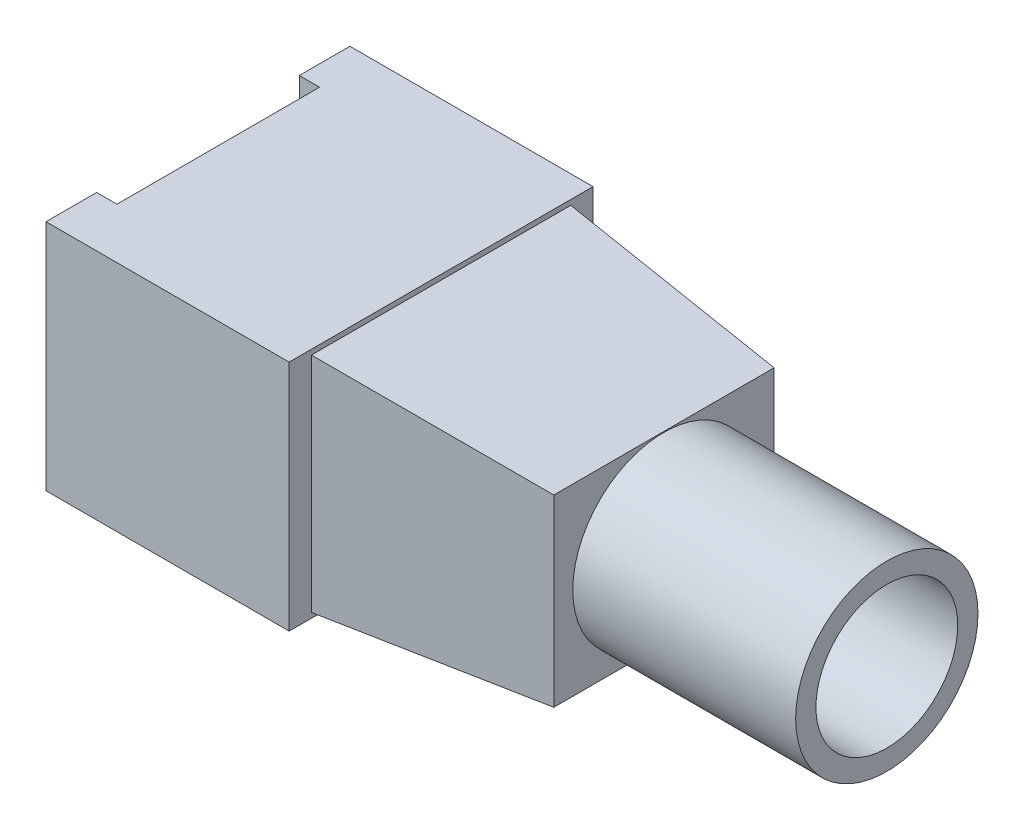
ISO-10303-21;
HEADER;
FILE_DESCRIPTION(('STEP AP214'),'2;1');
FILE_NAME('part.step','',(''),(''),'','','');
FILE_SCHEMA(('AUTOMOTIVE_DESIGN { 1 0 10303 214 1 1 1 1 }'));
ENDSEC;
DATA;
#1=APPLICATION_CONTEXT('core data for automotive mechanical design processes');
#2=APPLICATION_PROTOCOL_DEFINITION('international standard','automotive_design',2000,#1);
#3=PRODUCT_CONTEXT('',#1,'mechanical');
#4=PRODUCT('Part','Part','',(#3));
#5=PRODUCT_RELATED_PRODUCT_CATEGORY('part','',(#4));
#6=PRODUCT_DEFINITION_FORMATION('','',#4);
#7=PRODUCT_DEFINITION_CONTEXT('part definition',#1,'design');
#8=PRODUCT_DEFINITION('design','',#6,#7);
#9=PRODUCT_DEFINITION_SHAPE('','',#8);
#10=(LENGTH_UNIT() NAMED_UNIT(*) SI_UNIT(.MILLI.,.METRE.));
#11=(NAMED_UNIT(*) PLANE_ANGLE_UNIT() SI_UNIT($,.RADIAN.));
#12=(NAMED_UNIT(*) SI_UNIT($,.STERADIAN.) SOLID_ANGLE_UNIT());
#13=UNCERTAINTY_MEASURE_WITH_UNIT(LENGTH_MEASURE(1.E-05),#10,'distance_accuracy_value','');
#14=(GEOMETRIC_REPRESENTATION_CONTEXT(3) GLOBAL_UNCERTAINTY_ASSIGNED_CONTEXT((#13)) GLOBAL_UNIT_ASSIGNED_CONTEXT((#10,
#11,#12)) REPRESENTATION_CONTEXT('',''));
#15=CARTESIAN_POINT('',(0.,0.,0.));
#16=DIRECTION('',(0.,0.,1.));
#17=DIRECTION('',(1.,0.,0.));
#18=AXIS2_PLACEMENT_3D('',#15,#16,#17);
#19=CARTESIAN_POINT('',(6.,11.5,-7.5));
#20=DIRECTION('',(-1.,0.,0.));
#21=DIRECTION('',(0.,0.,1.));
#22=AXIS2_PLACEMENT_3D('',#19,#20,#21);
#23=PLANE('',#22);
#24=DIRECTION('',(0.,0.,-1.));
#25=VECTOR('',#24,1.);
#26=CARTESIAN_POINT('',(6.,0.,-7.5));
#27=LINE('',#26,#25);
#28=CARTESIAN_POINT('',(6.,0.,7.5));
#29=VERTEX_POINT('',#28);
#30=CARTESIAN_POINT('',(6.,0.,-7.5));
#31=VERTEX_POINT('',#30);
#32=EDGE_CURVE('E173',#29,#31,#27,.T.);
#33=ORIENTED_EDGE('',*,*,#32,.T.);
#34=DIRECTION('',(0.,-1.,0.));
#35=VECTOR('',#34,1.);
#36=CARTESIAN_POINT('',(6.,11.5,-7.5));
#37=LINE('',#36,#35);
#38=CARTESIAN_POINT('',(6.,11.5,-7.5));
#39=VERTEX_POINT('',#38);
#40=EDGE_CURVE('E41',#39,#31,#37,.T.);
#41=ORIENTED_EDGE('',*,*,#40,.F.);
#42=DIRECTION('',(0.,0.,-1.));
#43=VECTOR('',#42,1.);
#44=CARTESIAN_POINT('',(6.,11.5,-7.5));
#45=LINE('',#44,#43);
#46=CARTESIAN_POINT('',(6.,11.5,7.5));
#47=VERTEX_POINT('',#46);
#48=EDGE_CURVE('E154',#47,#39,#45,.T.);
#49=ORIENTED_EDGE('',*,*,#48,.F.);
#50=DIRECTION('',(0.,-1.,0.));
#51=VECTOR('',#50,1.);
#52=CARTESIAN_POINT('',(6.,11.5,7.5));
#53=LINE('',#52,#51);
#54=EDGE_CURVE('E172',#47,#29,#53,.T.);
#55=ORIENTED_EDGE('',*,*,#54,.T.);
#56=EDGE_LOOP('',(#33,#41,#49,#55));
#57=FACE_BOUND('',#56,.T.);
#58=DIRECTION('',(0.,1.,0.));
#59=VECTOR('',#58,1.);
#60=CARTESIAN_POINT('',(6.,11.25,-6.4));
#61=LINE('',#60,#59);
#62=CARTESIAN_POINT('',(6.,0.249999999999999,-6.4));
#63=VERTEX_POINT('',#62);
#64=CARTESIAN_POINT('',(6.,11.25,-6.4));
#65=VERTEX_POINT('',#64);
#66=EDGE_CURVE('E118',#63,#65,#61,.T.);
#67=ORIENTED_EDGE('',*,*,#66,.F.);
#68=DIRECTION('',(0.,0.,-1.));
#69=VECTOR('',#68,1.);
#70=CARTESIAN_POINT('',(6.,0.249999999999999,6.4));
#71=LINE('',#70,#69);
#72=CARTESIAN_POINT('',(6.,0.25,6.4));
#73=VERTEX_POINT('',#72);
#74=EDGE_CURVE('E120',#73,#63,#71,.T.);
#75=ORIENTED_EDGE('',*,*,#74,.F.);
#76=DIRECTION('',(0.,-1.,0.));
#77=VECTOR('',#76,1.);
#78=CARTESIAN_POINT('',(6.,11.25,6.4));
#79=LINE('',#78,#77);
#80=CARTESIAN_POINT('',(6.,11.25,6.4));
#81=VERTEX_POINT('',#80);
#82=EDGE_CURVE('E53',#81,#73,#79,.T.);
#83=ORIENTED_EDGE('',*,*,#82,.F.);
#84=DIRECTION('',(0.,0.,1.));
#85=VECTOR('',#84,1.);
#86=CARTESIAN_POINT('',(6.,11.25,6.4));
#87=LINE('',#86,#85);
#88=EDGE_CURVE('E48',#65,#81,#87,.T.);
#89=ORIENTED_EDGE('',*,*,#88,.F.);
#90=EDGE_LOOP('',(#67,#75,#83,#89));
#91=FACE_BOUND('',#90,.T.);
#92=ADVANCED_FACE('F34',(#57,#91),#23,.F.);
#93=CARTESIAN_POINT('',(-6.,11.5,-7.5));
#94=DIRECTION('',(0.,0.,1.));
#95=DIRECTION('',(1.,0.,0.));
#96=AXIS2_PLACEMENT_3D('',#93,#94,#95);
#97=PLANE('',#96);
#98=DIRECTION('',(-1.,0.,0.));
#99=VECTOR('',#98,1.);
#100=CARTESIAN_POINT('',(-6.,0.,-7.5));
#101=LINE('',#100,#99);
#102=CARTESIAN_POINT('',(-6.,0.,-7.5));
#103=VERTEX_POINT('',#102);
#104=EDGE_CURVE('E176',#31,#103,#101,.T.);
#105=ORIENTED_EDGE('',*,*,#104,.T.);
#106=DIRECTION('',(0.,-1.,0.));
#107=VECTOR('',#106,1.);
#108=CARTESIAN_POINT('',(-6.,11.5,-7.5));
#109=LINE('',#108,#107);
#110=CARTESIAN_POINT('',(-6.,11.5,-7.5));
#111=VERTEX_POINT('',#110);
#112=EDGE_CURVE('E206',#111,#103,#109,.T.);
#113=ORIENTED_EDGE('',*,*,#112,.F.);
#114=DIRECTION('',(-1.,0.,0.));
#115=VECTOR('',#114,1.);
#116=CARTESIAN_POINT('',(-6.,11.5,-7.5));
#117=LINE('',#116,#115);
#118=EDGE_CURVE('E157',#39,#111,#117,.T.);
#119=ORIENTED_EDGE('',*,*,#118,.F.);
#120=ORIENTED_EDGE('',*,*,#40,.T.);
#121=EDGE_LOOP('',(#105,#113,#119,#120));
#122=FACE_BOUND('',#121,.T.);
#123=ADVANCED_FACE('F211',(#122),#97,.F.);
#124=CARTESIAN_POINT('',(-6.,11.5,-7.5));
#125=DIRECTION('',(1.,0.,0.));
#126=DIRECTION('',(0.,0.,-1.));
#127=AXIS2_PLACEMENT_3D('',#124,#125,#126);
#128=PLANE('',#127);
#129=DIRECTION('',(0.,0.,1.));
#130=VECTOR('',#129,1.);
#131=CARTESIAN_POINT('',(-6.,0.,-7.5));
#132=LINE('',#131,#130);
#133=CARTESIAN_POINT('',(-6.,0.,-5.));
#134=VERTEX_POINT('',#133);
#135=EDGE_CURVE('E178',#103,#134,#132,.T.);
#136=ORIENTED_EDGE('',*,*,#135,.T.);
#137=DIRECTION('',(0.,-1.,0.));
#138=VECTOR('',#137,1.);
#139=CARTESIAN_POINT('',(-6.,11.5,-5.));
#140=LINE('',#139,#138);
#141=CARTESIAN_POINT('',(-6.,11.5,-5.));
#142=VERTEX_POINT('',#141);
#143=EDGE_CURVE('E203',#142,#134,#140,.T.);
#144=ORIENTED_EDGE('',*,*,#143,.F.);
#145=DIRECTION('',(0.,0.,1.));
#146=VECTOR('',#145,1.);
#147=CARTESIAN_POINT('',(-6.,11.5,-7.5));
#148=LINE('',#147,#146);
#149=EDGE_CURVE('E160',#111,#142,#148,.T.);
#150=ORIENTED_EDGE('',*,*,#149,.F.);
#151=ORIENTED_EDGE('',*,*,#112,.T.);
#152=EDGE_LOOP('',(#136,#144,#150,#151));
#153=FACE_BOUND('',#152,.T.);
#154=ADVANCED_FACE('F226',(#153),#128,.F.);
#155=CARTESIAN_POINT('',(-6.,11.5,-5.));
#156=DIRECTION('',(0.,0.,-1.));
#157=DIRECTION('',(-1.,0.,0.));
#158=AXIS2_PLACEMENT_3D('',#155,#156,#157);
#159=PLANE('',#158);
#160=DIRECTION('',(1.,0.,0.));
#161=VECTOR('',#160,1.);
#162=CARTESIAN_POINT('',(-6.,0.,-5.));
#163=LINE('',#162,#161);
#164=CARTESIAN_POINT('',(-5.,0.,-5.));
#165=VERTEX_POINT('',#164);
#166=EDGE_CURVE('E180',#134,#165,#163,.T.);
#167=ORIENTED_EDGE('',*,*,#166,.T.);
#168=DIRECTION('',(0.,-1.,0.));
#169=VECTOR('',#168,1.);
#170=CARTESIAN_POINT('',(-5.,11.5,-5.));
#171=LINE('',#170,#169);
#172=CARTESIAN_POINT('',(-5.,11.5,-5.));
#173=VERTEX_POINT('',#172);
#174=EDGE_CURVE('E200',#173,#165,#171,.T.);
#175=ORIENTED_EDGE('',*,*,#174,.F.);
#176=DIRECTION('',(1.,0.,0.));
#177=VECTOR('',#176,1.);
#178=CARTESIAN_POINT('',(-6.,11.5,-5.));
#179=LINE('',#178,#177);
#180=EDGE_CURVE('E162',#142,#173,#179,.T.);
#181=ORIENTED_EDGE('',*,*,#180,.F.);
#182=ORIENTED_EDGE('',*,*,#143,.T.);
#183=EDGE_LOOP('',(#167,#175,#181,#182));
#184=FACE_BOUND('',#183,.T.);
#185=ADVANCED_FACE('F230',(#184),#159,.F.);
#186=CARTESIAN_POINT('',(-5.,11.5,5.));
#187=DIRECTION('',(1.,0.,0.));
#188=DIRECTION('',(0.,0.,-1.));
#189=AXIS2_PLACEMENT_3D('',#186,#187,#188);
#190=PLANE('',#189);
#191=DIRECTION('',(0.,0.,1.));
#192=VECTOR('',#191,1.);
#193=CARTESIAN_POINT('',(-5.,0.,5.));
#194=LINE('',#193,#192);
#195=CARTESIAN_POINT('',(-5.,0.,5.));
#196=VERTEX_POINT('',#195);
#197=EDGE_CURVE('E182',#165,#196,#194,.T.);
#198=ORIENTED_EDGE('',*,*,#197,.T.);
#199=DIRECTION('',(0.,-1.,0.));
#200=VECTOR('',#199,1.);
#201=CARTESIAN_POINT('',(-5.,11.5,5.));
#202=LINE('',#201,#200);
#203=CARTESIAN_POINT('',(-5.,11.5,5.));
#204=VERTEX_POINT('',#203);
#205=EDGE_CURVE('E197',#204,#196,#202,.T.);
#206=ORIENTED_EDGE('',*,*,#205,.F.);
#207=DIRECTION('',(0.,0.,1.));
#208=VECTOR('',#207,1.);
#209=CARTESIAN_POINT('',(-5.,11.5,5.));
#210=LINE('',#209,#208);
#211=EDGE_CURVE('E164',#173,#204,#210,.T.);
#212=ORIENTED_EDGE('',*,*,#211,.F.);
#213=ORIENTED_EDGE('',*,*,#174,.T.);
#214=EDGE_LOOP('',(#198,#206,#212,#213));
#215=FACE_BOUND('',#214,.T.);
#216=ADVANCED_FACE('F249',(#215),#190,.F.);
#217=CARTESIAN_POINT('',(-6.,11.5,5.));
#218=DIRECTION('',(0.,0.,1.));
#219=DIRECTION('',(1.,0.,0.));
#220=AXIS2_PLACEMENT_3D('',#217,#218,#219);
#221=PLANE('',#220);
#222=DIRECTION('',(-1.,0.,0.));
#223=VECTOR('',#222,1.);
#224=CARTESIAN_POINT('',(-6.,0.,5.));
#225=LINE('',#224,#223);
#226=CARTESIAN_POINT('',(-6.,0.,5.));
#227=VERTEX_POINT('',#226);
#228=EDGE_CURVE('E184',#196,#227,#225,.T.);
#229=ORIENTED_EDGE('',*,*,#228,.T.);
#230=DIRECTION('',(0.,-1.,0.));
#231=VECTOR('',#230,1.);
#232=CARTESIAN_POINT('',(-6.,11.5,5.));
#233=LINE('',#232,#231);
#234=CARTESIAN_POINT('',(-6.,11.5,5.));
#235=VERTEX_POINT('',#234);
#236=EDGE_CURVE('E194',#235,#227,#233,.T.);
#237=ORIENTED_EDGE('',*,*,#236,.F.);
#238=DIRECTION('',(-1.,0.,0.));
#239=VECTOR('',#238,1.);
#240=CARTESIAN_POINT('',(-6.,11.5,5.));
#241=LINE('',#240,#239);
#242=EDGE_CURVE('E166',#204,#235,#241,.T.);
#243=ORIENTED_EDGE('',*,*,#242,.F.);
#244=ORIENTED_EDGE('',*,*,#205,.T.);
#245=EDGE_LOOP('',(#229,#237,#243,#244));
#246=FACE_BOUND('',#245,.T.);
#247=ADVANCED_FACE('F246',(#246),#221,.F.);
#248=CARTESIAN_POINT('',(-6.,11.5,5.));
#249=DIRECTION('',(1.,0.,0.));
#250=DIRECTION('',(0.,0.,-1.));
#251=AXIS2_PLACEMENT_3D('',#248,#249,#250);
#252=PLANE('',#251);
#253=DIRECTION('',(0.,0.,1.));
#254=VECTOR('',#253,1.);
#255=CARTESIAN_POINT('',(-6.,0.,5.));
#256=LINE('',#255,#254);
#257=CARTESIAN_POINT('',(-6.,0.,7.5));
#258=VERTEX_POINT('',#257);
#259=EDGE_CURVE('E186',#227,#258,#256,.T.);
#260=ORIENTED_EDGE('',*,*,#259,.T.);
#261=DIRECTION('',(0.,-1.,0.));
#262=VECTOR('',#261,1.);
#263=CARTESIAN_POINT('',(-6.,11.5,7.5));
#264=LINE('',#263,#262);
#265=CARTESIAN_POINT('',(-6.,11.5,7.5));
#266=VERTEX_POINT('',#265);
#267=EDGE_CURVE('E191',#266,#258,#264,.T.);
#268=ORIENTED_EDGE('',*,*,#267,.F.);
#269=DIRECTION('',(0.,0.,1.));
#270=VECTOR('',#269,1.);
#271=CARTESIAN_POINT('',(-6.,11.5,5.));
#272=LINE('',#271,#270);
#273=EDGE_CURVE('E168',#235,#266,#272,.T.);
#274=ORIENTED_EDGE('',*,*,#273,.F.);
#275=ORIENTED_EDGE('',*,*,#236,.T.);
#276=EDGE_LOOP('',(#260,#268,#274,#275));
#277=FACE_BOUND('',#276,.T.);
#278=ADVANCED_FACE('F242',(#277),#252,.F.);
#279=CARTESIAN_POINT('',(-6.,11.5,7.5));
#280=DIRECTION('',(0.,0.,-1.));
#281=DIRECTION('',(-1.,0.,0.));
#282=AXIS2_PLACEMENT_3D('',#279,#280,#281);
#283=PLANE('',#282);
#284=DIRECTION('',(1.,0.,0.));
#285=VECTOR('',#284,1.);
#286=CARTESIAN_POINT('',(-6.,0.,7.5));
#287=LINE('',#286,#285);
#288=EDGE_CURVE('E158',#258,#29,#287,.T.);
#289=ORIENTED_EDGE('',*,*,#288,.T.);
#290=ORIENTED_EDGE('',*,*,#54,.F.);
#291=DIRECTION('',(1.,0.,0.));
#292=VECTOR('',#291,1.);
#293=CARTESIAN_POINT('',(-6.,11.5,7.5));
#294=LINE('',#293,#292);
#295=EDGE_CURVE('E170',#266,#47,#294,.T.);
#296=ORIENTED_EDGE('',*,*,#295,.F.);
#297=ORIENTED_EDGE('',*,*,#267,.T.);
#298=EDGE_LOOP('',(#289,#290,#296,#297));
#299=FACE_BOUND('',#298,.T.);
#300=ADVANCED_FACE('F240',(#299),#283,.F.);
#301=CARTESIAN_POINT('',(0.,11.5,0.));
#302=DIRECTION('',(0.,1.,0.));
#303=DIRECTION('',(0.,0.,1.));
#304=AXIS2_PLACEMENT_3D('',#301,#302,#303);
#305=PLANE('',#304);
#306=ORIENTED_EDGE('',*,*,#48,.T.);
#307=ORIENTED_EDGE('',*,*,#118,.T.);
#308=ORIENTED_EDGE('',*,*,#149,.T.);
#309=ORIENTED_EDGE('',*,*,#180,.T.);
#310=ORIENTED_EDGE('',*,*,#211,.T.);
#311=ORIENTED_EDGE('',*,*,#242,.T.);
#312=ORIENTED_EDGE('',*,*,#273,.T.);
#313=ORIENTED_EDGE('',*,*,#295,.T.);
#314=EDGE_LOOP('',(#306,#307,#308,#309,#310,#311,#312,#313));
#315=FACE_BOUND('',#314,.T.);
#316=ADVANCED_FACE('F234',(#315),#305,.T.);
#317=CARTESIAN_POINT('',(0.,0.,0.));
#318=DIRECTION('',(0.,1.,0.));
#319=DIRECTION('',(0.,0.,1.));
#320=AXIS2_PLACEMENT_3D('',#317,#318,#319);
#321=PLANE('',#320);
#322=ORIENTED_EDGE('',*,*,#32,.F.);
#323=ORIENTED_EDGE('',*,*,#288,.F.);
#324=ORIENTED_EDGE('',*,*,#259,.F.);
#325=ORIENTED_EDGE('',*,*,#228,.F.);
#326=ORIENTED_EDGE('',*,*,#197,.F.);
#327=ORIENTED_EDGE('',*,*,#166,.F.);
#328=ORIENTED_EDGE('',*,*,#135,.F.);
#329=ORIENTED_EDGE('',*,*,#104,.F.);
#330=EDGE_LOOP('',(#322,#323,#324,#325,#326,#327,#328,#329));
#331=FACE_BOUND('',#330,.T.);
#332=ADVANCED_FACE('F219',(#331),#321,.F.);
#333=CARTESIAN_POINT('',(6.,11.25,-6.4));
#334=DIRECTION('',(0.0871557427476584,0.,-0.996194698091746));
#335=DIRECTION('',(-0.996194698091746,0.,-0.0871557427476584));
#336=AXIS2_PLACEMENT_3D('',#333,#334,#335);
#337=PLANE('',#336);
#338=ORIENTED_EDGE('',*,*,#66,.T.);
#339=DIRECTION('',(-0.992432509138967,0.0868265938642478,-0.0868265938642478));
#340=VECTOR('',#339,1.);
#341=CARTESIAN_POINT('',(7.10297004043117,11.1535026252535,-6.30350262525354));
#342=LINE('',#341,#340);
#343=CARTESIAN_POINT('',(17.,10.2876247012148,-5.43762470121484));
#344=VERTEX_POINT('',#343);
#345=EDGE_CURVE('E146',#344,#65,#342,.T.);
#346=ORIENTED_EDGE('',*,*,#345,.F.);
#347=DIRECTION('',(0.,-1.,0.));
#348=VECTOR('',#347,1.);
#349=CARTESIAN_POINT('',(17.,11.25,-5.43762470121483));
#350=LINE('',#349,#348);
#351=CARTESIAN_POINT('',(17.,1.21237529878517,-5.43762470121484));
#352=VERTEX_POINT('',#351);
#353=EDGE_CURVE('E135',#352,#344,#350,.F.);
#354=ORIENTED_EDGE('',*,*,#353,.F.);
#355=DIRECTION('',(-0.992432509138967,-0.0868265938642478,-0.0868265938642478));
#356=VECTOR('',#355,1.);
#357=CARTESIAN_POINT('',(6.94786487849554,0.332927431422738,-6.31707256857726));
#358=LINE('',#357,#356);
#359=EDGE_CURVE('E131',#352,#63,#358,.T.);
#360=ORIENTED_EDGE('',*,*,#359,.T.);
#361=EDGE_LOOP('',(#338,#346,#354,#360));
#362=FACE_BOUND('',#361,.T.);
#363=ADVANCED_FACE('F137',(#362),#337,.T.);
#364=CARTESIAN_POINT('',(6.,11.25,6.4));
#365=DIRECTION('',(0.0871557427476584,0.996194698091746,0.));
#366=DIRECTION('',(-0.996194698091746,0.0871557427476584,0.));
#367=AXIS2_PLACEMENT_3D('',#364,#365,#366);
#368=PLANE('',#367);
#369=ORIENTED_EDGE('',*,*,#88,.T.);
#370=DIRECTION('',(-0.992432509138967,0.0868265938642478,0.0868265938642478));
#371=VECTOR('',#370,1.);
#372=CARTESIAN_POINT('',(6.,11.25,6.4));
#373=LINE('',#372,#371);
#374=CARTESIAN_POINT('',(17.,10.2876247012148,5.43762470121484));
#375=VERTEX_POINT('',#374);
#376=EDGE_CURVE('E141',#375,#81,#373,.T.);
#377=ORIENTED_EDGE('',*,*,#376,.F.);
#378=DIRECTION('',(0.,0.,-1.));
#379=VECTOR('',#378,1.);
#380=CARTESIAN_POINT('',(17.,10.2876247012148,6.4));
#381=LINE('',#380,#379);
#382=EDGE_CURVE('E151',#344,#375,#381,.F.);
#383=ORIENTED_EDGE('',*,*,#382,.F.);
#384=ORIENTED_EDGE('',*,*,#345,.T.);
#385=EDGE_LOOP('',(#369,#377,#383,#384));
#386=FACE_BOUND('',#385,.T.);
#387=ADVANCED_FACE('F327',(#386),#368,.T.);
#388=CARTESIAN_POINT('',(6.,11.25,6.4));
#389=DIRECTION('',(0.0871557427476584,0.,0.996194698091746));
#390=DIRECTION('',(0.996194698091746,0.,-0.0871557427476584));
#391=AXIS2_PLACEMENT_3D('',#388,#389,#390);
#392=PLANE('',#391);
#393=ORIENTED_EDGE('',*,*,#82,.T.);
#394=DIRECTION('',(-0.992432509138967,-0.0868265938642478,0.0868265938642478));
#395=VECTOR('',#394,1.);
#396=CARTESIAN_POINT('',(6.,0.249999999999999,6.4));
#397=LINE('',#396,#395);
#398=CARTESIAN_POINT('',(17.,1.21237529878517,5.43762470121484));
#399=VERTEX_POINT('',#398);
#400=EDGE_CURVE('E134',#399,#73,#397,.T.);
#401=ORIENTED_EDGE('',*,*,#400,.F.);
#402=DIRECTION('',(0.,1.,0.));
#403=VECTOR('',#402,1.);
#404=CARTESIAN_POINT('',(17.,11.25,5.43762470121483));
#405=LINE('',#404,#403);
#406=EDGE_CURVE('E143',#375,#399,#405,.F.);
#407=ORIENTED_EDGE('',*,*,#406,.F.);
#408=ORIENTED_EDGE('',*,*,#376,.T.);
#409=EDGE_LOOP('',(#393,#401,#407,#408));
#410=FACE_BOUND('',#409,.T.);
#411=ADVANCED_FACE('F336',(#410),#392,.T.);
#412=CARTESIAN_POINT('',(6.,0.249999999999999,6.4));
#413=DIRECTION('',(0.0871557427476584,-0.996194698091746,0.));
#414=DIRECTION('',(0.996194698091746,0.0871557427476584,0.));
#415=AXIS2_PLACEMENT_3D('',#412,#413,#414);
#416=PLANE('',#415);
#417=ORIENTED_EDGE('',*,*,#74,.T.);
#418=ORIENTED_EDGE('',*,*,#359,.F.);
#419=DIRECTION('',(0.,0.,1.));
#420=VECTOR('',#419,1.);
#421=CARTESIAN_POINT('',(17.,1.21237529878517,6.4));
#422=LINE('',#421,#420);
#423=EDGE_CURVE('E139',#399,#352,#422,.F.);
#424=ORIENTED_EDGE('',*,*,#423,.F.);
#425=ORIENTED_EDGE('',*,*,#400,.T.);
#426=EDGE_LOOP('',(#417,#418,#424,#425));
#427=FACE_BOUND('',#426,.T.);
#428=ADVANCED_FACE('F129',(#427),#416,.T.);
#429=CARTESIAN_POINT('',(17.,0.,0.));
#430=DIRECTION('',(1.,0.,0.));
#431=DIRECTION('',(0.,0.,-1.));
#432=AXIS2_PLACEMENT_3D('',#429,#430,#431);
#433=PLANE('',#432);
#434=CARTESIAN_POINT('',(17.,5.75,0.));
#435=DIRECTION('',(1.,0.,0.));
#436=DIRECTION('',(0.,0.,-1.));
#437=AXIS2_PLACEMENT_3D('',#434,#435,#436);
#438=CIRCLE('',#437,4.5);
#439=CARTESIAN_POINT('',(17.,5.75,-4.5));
#440=VERTEX_POINT('',#439);
#441=EDGE_CURVE('E413',#440,#440,#438,.T.);
#442=ORIENTED_EDGE('',*,*,#441,.F.);
#443=EDGE_LOOP('',(#442));
#444=FACE_BOUND('',#443,.T.);
#445=ORIENTED_EDGE('',*,*,#353,.T.);
#446=ORIENTED_EDGE('',*,*,#382,.T.);
#447=ORIENTED_EDGE('',*,*,#406,.T.);
#448=ORIENTED_EDGE('',*,*,#423,.T.);
#449=EDGE_LOOP('',(#445,#446,#447,#448));
#450=FACE_BOUND('',#449,.T.);
#451=ADVANCED_FACE('F355',(#444,#450),#433,.T.);
#452=CARTESIAN_POINT('',(28.,5.75,0.));
#453=DIRECTION('',(1.,0.,0.));
#454=DIRECTION('',(0.,0.,-1.));
#455=AXIS2_PLACEMENT_3D('',#452,#453,#454);
#456=PLANE('',#455);
#457=CARTESIAN_POINT('',(28.,5.75,0.));
#458=DIRECTION('',(1.,0.,0.));
#459=DIRECTION('',(0.,0.,-1.));
#460=AXIS2_PLACEMENT_3D('',#457,#458,#459);
#461=CIRCLE('',#460,4.5);
#462=CARTESIAN_POINT('',(28.,5.75,-4.5));
#463=VERTEX_POINT('',#462);
#464=EDGE_CURVE('E124',#463,#463,#461,.T.);
#465=ORIENTED_EDGE('',*,*,#464,.T.);
#466=EDGE_LOOP('',(#465));
#467=FACE_BOUND('',#466,.T.);
#468=CARTESIAN_POINT('',(28.,5.75,0.));
#469=DIRECTION('',(1.,0.,0.));
#470=DIRECTION('',(0.,0.,-1.));
#471=AXIS2_PLACEMENT_3D('',#468,#469,#470);
#472=CIRCLE('',#471,3.5);
#473=CARTESIAN_POINT('',(28.,5.75,-3.5));
#474=VERTEX_POINT('',#473);
#475=EDGE_CURVE('E411',#474,#474,#472,.T.);
#476=ORIENTED_EDGE('',*,*,#475,.F.);
#477=EDGE_LOOP('',(#476));
#478=FACE_BOUND('',#477,.T.);
#479=ADVANCED_FACE('F364',(#467,#478),#456,.T.);
#480=CARTESIAN_POINT('',(28.,5.75,0.));
#481=DIRECTION('',(-1.,0.,0.));
#482=DIRECTION('',(0.,0.,1.));
#483=AXIS2_PLACEMENT_3D('',#480,#481,#482);
#484=CYLINDRICAL_SURFACE('',#483,4.5);
#485=ORIENTED_EDGE('',*,*,#464,.F.);
#486=EDGE_LOOP('',(#485));
#487=FACE_BOUND('',#486,.T.);
#488=ORIENTED_EDGE('',*,*,#441,.T.);
#489=EDGE_LOOP('',(#488));
#490=FACE_BOUND('',#489,.T.);
#491=ADVANCED_FACE('F376',(#487,#490),#484,.T.);
#492=CARTESIAN_POINT('',(28.,5.75,0.));
#493=DIRECTION('',(-1.,0.,0.));
#494=DIRECTION('',(0.,0.,1.));
#495=AXIS2_PLACEMENT_3D('',#492,#493,#494);
#496=CYLINDRICAL_SURFACE('',#495,3.5);
#497=ORIENTED_EDGE('',*,*,#475,.T.);
#498=EDGE_LOOP('',(#497));
#499=FACE_BOUND('',#498,.T.);
#500=CARTESIAN_POINT('',(17.,5.75,0.));
#501=DIRECTION('',(1.,0.,0.));
#502=DIRECTION('',(0.,0.,-1.));
#503=AXIS2_PLACEMENT_3D('',#500,#501,#502);
#504=CIRCLE('',#503,3.5);
#505=CARTESIAN_POINT('',(17.,5.75,-3.5));
#506=VERTEX_POINT('',#505);
#507=EDGE_CURVE('E11',#506,#506,#504,.F.);
#508=ORIENTED_EDGE('',*,*,#507,.T.);
#509=EDGE_LOOP('',(#508));
#510=FACE_BOUND('',#509,.T.);
#511=ADVANCED_FACE('F386',(#499,#510),#496,.F.);
#512=ORIENTED_EDGE('',*,*,#507,.F.);
#513=EDGE_LOOP('',(#512));
#514=FACE_BOUND('',#513,.T.);
#515=ADVANCED_FACE('F367',(#514),#433,.T.);
#516=CLOSED_SHELL('',(#92,#123,#154,#185,#216,#247,#278,#300,#316,#332,#363,#387,#411,#428,#451,
#479,#491,#511,#515));
#517=MANIFOLD_SOLID_BREP('B2',#516);
#518=ADVANCED_BREP_SHAPE_REPRESENTATION('',(#18,#517),#14);
#519=SHAPE_DEFINITION_REPRESENTATION(#9,#518);
ENDSEC;
END-ISO-10303-21;
